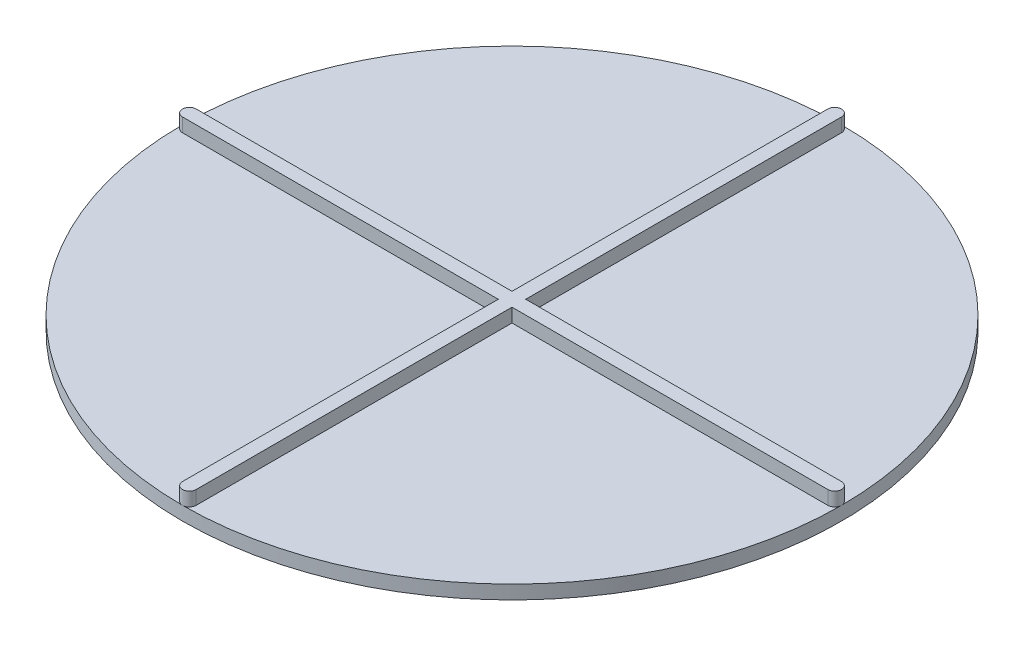
ISO-10303-21;
HEADER;
FILE_DESCRIPTION(('STEP AP214'),'2;1');
FILE_NAME('part.step','',(''),(''),'','','');
FILE_SCHEMA(('AUTOMOTIVE_DESIGN { 1 0 10303 214 1 1 1 1 }'));
ENDSEC;
DATA;
#1=APPLICATION_CONTEXT('core data for automotive mechanical design processes');
#2=APPLICATION_PROTOCOL_DEFINITION('international standard','automotive_design',2000,#1);
#3=PRODUCT_CONTEXT('',#1,'mechanical');
#4=PRODUCT('Part','Part','',(#3));
#5=PRODUCT_RELATED_PRODUCT_CATEGORY('part','',(#4));
#6=PRODUCT_DEFINITION_FORMATION('','',#4);
#7=PRODUCT_DEFINITION_CONTEXT('part definition',#1,'design');
#8=PRODUCT_DEFINITION('design','',#6,#7);
#9=PRODUCT_DEFINITION_SHAPE('','',#8);
#10=(LENGTH_UNIT() NAMED_UNIT(*) SI_UNIT(.MILLI.,.METRE.));
#11=(NAMED_UNIT(*) PLANE_ANGLE_UNIT() SI_UNIT($,.RADIAN.));
#12=(NAMED_UNIT(*) SI_UNIT($,.STERADIAN.) SOLID_ANGLE_UNIT());
#13=UNCERTAINTY_MEASURE_WITH_UNIT(LENGTH_MEASURE(1.E-05),#10,'distance_accuracy_value','');
#14=(GEOMETRIC_REPRESENTATION_CONTEXT(3) GLOBAL_UNCERTAINTY_ASSIGNED_CONTEXT((#13)) GLOBAL_UNIT_ASSIGNED_CONTEXT((#10,
#11,#12)) REPRESENTATION_CONTEXT('',''));
#15=CARTESIAN_POINT('',(0.,0.,0.));
#16=DIRECTION('',(0.,0.,1.));
#17=DIRECTION('',(1.,0.,0.));
#18=AXIS2_PLACEMENT_3D('',#15,#16,#17);
#19=CARTESIAN_POINT('',(0.,3.175,0.));
#20=DIRECTION('',(0.,1.,0.));
#21=DIRECTION('',(0.,0.,1.));
#22=AXIS2_PLACEMENT_3D('',#19,#20,#21);
#23=PLANE('',#22);
#24=CARTESIAN_POINT('',(74.6125,3.175,0.));
#25=DIRECTION('',(0.,1.,0.));
#26=DIRECTION('',(0.,0.,1.));
#27=AXIS2_PLACEMENT_3D('',#24,#25,#26);
#28=CIRCLE('',#27,1.5875);
#29=CARTESIAN_POINT('',(74.6125,3.175,1.5875));
#30=VERTEX_POINT('',#29);
#31=CARTESIAN_POINT('',(76.2,3.175,0.));
#32=VERTEX_POINT('',#31);
#33=EDGE_CURVE('E74',#30,#32,#28,.T.);
#34=ORIENTED_EDGE('',*,*,#33,.F.);
#35=DIRECTION('',(1.,0.,0.));
#36=VECTOR('',#35,1.);
#37=CARTESIAN_POINT('',(-74.6125,3.175,1.5875));
#38=LINE('',#37,#36);
#39=CARTESIAN_POINT('',(1.58750000000002,3.175,1.58750000000001));
#40=VERTEX_POINT('',#39);
#41=EDGE_CURVE('E84',#40,#30,#38,.T.);
#42=ORIENTED_EDGE('',*,*,#41,.F.);
#43=DIRECTION('',(0.,0.,1.));
#44=VECTOR('',#43,1.);
#45=CARTESIAN_POINT('',(1.58750000000002,3.175,-74.6125));
#46=LINE('',#45,#44);
#47=CARTESIAN_POINT('',(1.58750000000002,3.175,74.6125));
#48=VERTEX_POINT('',#47);
#49=EDGE_CURVE('E439',#40,#48,#46,.T.);
#50=ORIENTED_EDGE('',*,*,#49,.T.);
#51=CARTESIAN_POINT('',(0.,3.175,74.6125));
#52=DIRECTION('',(0.,1.,0.));
#53=DIRECTION('',(0.,0.,1.));
#54=AXIS2_PLACEMENT_3D('',#51,#52,#53);
#55=CIRCLE('',#54,1.5875);
#56=CARTESIAN_POINT('',(0.,3.175,76.2));
#57=VERTEX_POINT('',#56);
#58=EDGE_CURVE('E72',#57,#48,#55,.T.);
#59=ORIENTED_EDGE('',*,*,#58,.F.);
#60=CARTESIAN_POINT('',(0.,3.175,0.));
#61=DIRECTION('',(0.,1.,0.));
#62=DIRECTION('',(0.,0.,1.));
#63=AXIS2_PLACEMENT_3D('',#60,#61,#62);
#64=CIRCLE('',#63,76.2);
#65=EDGE_CURVE('E242',#57,#32,#64,.T.);
#66=ORIENTED_EDGE('',*,*,#65,.T.);
#67=EDGE_LOOP('',(#34,#42,#50,#59,#66));
#68=FACE_BOUND('',#67,.T.);
#69=ADVANCED_FACE('F63',(#68),#23,.T.);
#70=CARTESIAN_POINT('',(74.6125,3.175,-1.5875));
#71=VERTEX_POINT('',#70);
#72=EDGE_CURVE('E12',#32,#71,#28,.T.);
#73=ORIENTED_EDGE('',*,*,#72,.F.);
#74=CARTESIAN_POINT('',(0.,3.175,-76.2));
#75=VERTEX_POINT('',#74);
#76=EDGE_CURVE('E243',#32,#75,#64,.T.);
#77=ORIENTED_EDGE('',*,*,#76,.T.);
#78=CARTESIAN_POINT('',(0.,3.175,-74.6125));
#79=DIRECTION('',(0.,1.,0.));
#80=DIRECTION('',(0.,0.,1.));
#81=AXIS2_PLACEMENT_3D('',#78,#79,#80);
#82=CIRCLE('',#81,1.5875);
#83=CARTESIAN_POINT('',(1.58750000000002,3.175,-74.6125));
#84=VERTEX_POINT('',#83);
#85=EDGE_CURVE('E237',#84,#75,#82,.T.);
#86=ORIENTED_EDGE('',*,*,#85,.F.);
#87=CARTESIAN_POINT('',(1.58750000000002,3.175,-1.58750000000001));
#88=VERTEX_POINT('',#87);
#89=EDGE_CURVE('E188',#84,#88,#46,.T.);
#90=ORIENTED_EDGE('',*,*,#89,.T.);
#91=DIRECTION('',(1.,0.,0.));
#92=VECTOR('',#91,1.);
#93=CARTESIAN_POINT('',(-74.6125,3.175,-1.5875));
#94=LINE('',#93,#92);
#95=EDGE_CURVE('E218',#88,#71,#94,.T.);
#96=ORIENTED_EDGE('',*,*,#95,.T.);
#97=EDGE_LOOP('',(#73,#77,#86,#90,#96));
#98=FACE_BOUND('',#97,.T.);
#99=ADVANCED_FACE('F272',(#98),#23,.T.);
#100=CARTESIAN_POINT('',(-1.58749999999998,3.175,74.6125));
#101=VERTEX_POINT('',#100);
#102=EDGE_CURVE('E433',#101,#57,#55,.T.);
#103=ORIENTED_EDGE('',*,*,#102,.F.);
#104=DIRECTION('',(0.,0.,1.));
#105=VECTOR('',#104,1.);
#106=CARTESIAN_POINT('',(-1.58749999999998,3.175,-74.6125));
#107=LINE('',#106,#105);
#108=CARTESIAN_POINT('',(-1.58749999999998,3.175,1.58750000000001));
#109=VERTEX_POINT('',#108);
#110=EDGE_CURVE('E443',#109,#101,#107,.T.);
#111=ORIENTED_EDGE('',*,*,#110,.F.);
#112=CARTESIAN_POINT('',(-74.6125,3.175,1.5875));
#113=VERTEX_POINT('',#112);
#114=EDGE_CURVE('E208',#113,#109,#38,.T.);
#115=ORIENTED_EDGE('',*,*,#114,.F.);
#116=CARTESIAN_POINT('',(-74.6125,3.175,0.));
#117=DIRECTION('',(0.,1.,0.));
#118=DIRECTION('',(0.,0.,1.));
#119=AXIS2_PLACEMENT_3D('',#116,#117,#118);
#120=CIRCLE('',#119,1.5875);
#121=CARTESIAN_POINT('',(-76.2,3.175,0.));
#122=VERTEX_POINT('',#121);
#123=EDGE_CURVE('E224',#122,#113,#120,.T.);
#124=ORIENTED_EDGE('',*,*,#123,.F.);
#125=EDGE_CURVE('E244',#122,#57,#64,.T.);
#126=ORIENTED_EDGE('',*,*,#125,.T.);
#127=EDGE_LOOP('',(#103,#111,#115,#124,#126));
#128=FACE_BOUND('',#127,.T.);
#129=ADVANCED_FACE('F271',(#128),#23,.T.);
#130=CARTESIAN_POINT('',(0.,3.175,0.));
#131=DIRECTION('',(0.,-1.,0.));
#132=DIRECTION('',(0.,0.,-1.));
#133=AXIS2_PLACEMENT_3D('',#130,#131,#132);
#134=CYLINDRICAL_SURFACE('',#133,76.2);
#135=ORIENTED_EDGE('',*,*,#65,.F.);
#136=ORIENTED_EDGE('',*,*,#125,.F.);
#137=EDGE_CURVE('E248',#75,#122,#64,.T.);
#138=ORIENTED_EDGE('',*,*,#137,.F.);
#139=ORIENTED_EDGE('',*,*,#76,.F.);
#140=EDGE_LOOP('',(#135,#136,#138,#139));
#141=FACE_BOUND('',#140,.T.);
#142=CARTESIAN_POINT('',(0.,0.,0.));
#143=DIRECTION('',(0.,1.,0.));
#144=DIRECTION('',(0.,0.,1.));
#145=AXIS2_PLACEMENT_3D('',#142,#143,#144);
#146=CIRCLE('',#145,76.2);
#147=CARTESIAN_POINT('',(0.,0.,76.2));
#148=VERTEX_POINT('',#147);
#149=EDGE_CURVE('E67',#148,#148,#146,.T.);
#150=ORIENTED_EDGE('',*,*,#149,.T.);
#151=EDGE_LOOP('',(#150));
#152=FACE_BOUND('',#151,.T.);
#153=ADVANCED_FACE('F65',(#141,#152),#134,.T.);
#154=CARTESIAN_POINT('',(-74.6125,3.175,-1.5875));
#155=VERTEX_POINT('',#154);
#156=EDGE_CURVE('E221',#155,#122,#120,.T.);
#157=ORIENTED_EDGE('',*,*,#156,.F.);
#158=CARTESIAN_POINT('',(-1.58749999999998,3.175,-1.58750000000001));
#159=VERTEX_POINT('',#158);
#160=EDGE_CURVE('E219',#155,#159,#94,.T.);
#161=ORIENTED_EDGE('',*,*,#160,.T.);
#162=CARTESIAN_POINT('',(-1.58749999999998,3.175,-74.6125));
#163=VERTEX_POINT('',#162);
#164=EDGE_CURVE('E440',#163,#159,#107,.T.);
#165=ORIENTED_EDGE('',*,*,#164,.F.);
#166=EDGE_CURVE('E193',#75,#163,#82,.T.);
#167=ORIENTED_EDGE('',*,*,#166,.F.);
#168=ORIENTED_EDGE('',*,*,#137,.T.);
#169=EDGE_LOOP('',(#157,#161,#165,#167,#168));
#170=FACE_BOUND('',#169,.T.);
#171=ADVANCED_FACE('F260',(#170),#23,.T.);
#172=CARTESIAN_POINT('',(0.,0.,0.));
#173=DIRECTION('',(0.,1.,0.));
#174=DIRECTION('',(0.,0.,1.));
#175=AXIS2_PLACEMENT_3D('',#172,#173,#174);
#176=PLANE('',#175);
#177=ORIENTED_EDGE('',*,*,#149,.F.);
#178=EDGE_LOOP('',(#177));
#179=FACE_BOUND('',#178,.T.);
#180=ADVANCED_FACE('F257',(#179),#176,.F.);
#181=CARTESIAN_POINT('',(-1.58749999999998,6.35,-74.6125));
#182=DIRECTION('',(1.,0.,0.));
#183=DIRECTION('',(0.,0.,-1.));
#184=AXIS2_PLACEMENT_3D('',#181,#182,#183);
#185=PLANE('',#184);
#186=DIRECTION('',(0.,1.,0.));
#187=VECTOR('',#186,1.);
#188=CARTESIAN_POINT('',(-1.58749999999998,6.35,1.58750000000001));
#189=LINE('',#188,#187);
#190=CARTESIAN_POINT('',(-1.58749999999998,6.35,1.58750000000001));
#191=VERTEX_POINT('',#190);
#192=EDGE_CURVE('E239',#109,#191,#189,.T.);
#193=ORIENTED_EDGE('',*,*,#192,.F.);
#194=ORIENTED_EDGE('',*,*,#110,.T.);
#195=DIRECTION('',(0.,-1.,0.));
#196=VECTOR('',#195,1.);
#197=CARTESIAN_POINT('',(-1.58749999999998,6.35,74.6125));
#198=LINE('',#197,#196);
#199=CARTESIAN_POINT('',(-1.58749999999998,6.35,74.6125));
#200=VERTEX_POINT('',#199);
#201=EDGE_CURVE('E195',#200,#101,#198,.T.);
#202=ORIENTED_EDGE('',*,*,#201,.F.);
#203=DIRECTION('',(0.,0.,1.));
#204=VECTOR('',#203,1.);
#205=CARTESIAN_POINT('',(-1.58749999999998,6.35,-74.6125));
#206=LINE('',#205,#204);
#207=EDGE_CURVE('E177',#191,#200,#206,.T.);
#208=ORIENTED_EDGE('',*,*,#207,.F.);
#209=EDGE_LOOP('',(#193,#194,#202,#208));
#210=FACE_BOUND('',#209,.T.);
#211=ADVANCED_FACE('F259',(#210),#185,.F.);
#212=CARTESIAN_POINT('',(0.,6.35,74.6125));
#213=DIRECTION('',(0.,-1.,0.));
#214=DIRECTION('',(0.,0.,-1.));
#215=AXIS2_PLACEMENT_3D('',#212,#213,#214);
#216=CYLINDRICAL_SURFACE('',#215,1.5875);
#217=ORIENTED_EDGE('',*,*,#102,.T.);
#218=ORIENTED_EDGE('',*,*,#58,.T.);
#219=DIRECTION('',(0.,-1.,0.));
#220=VECTOR('',#219,1.);
#221=CARTESIAN_POINT('',(1.58750000000002,6.35,74.6125));
#222=LINE('',#221,#220);
#223=CARTESIAN_POINT('',(1.58750000000002,6.35,74.6125));
#224=VERTEX_POINT('',#223);
#225=EDGE_CURVE('E200',#224,#48,#222,.T.);
#226=ORIENTED_EDGE('',*,*,#225,.F.);
#227=CARTESIAN_POINT('',(0.,6.35,74.6125));
#228=DIRECTION('',(0.,1.,0.));
#229=DIRECTION('',(0.,0.,1.));
#230=AXIS2_PLACEMENT_3D('',#227,#228,#229);
#231=CIRCLE('',#230,1.5875);
#232=EDGE_CURVE('E176',#200,#224,#231,.T.);
#233=ORIENTED_EDGE('',*,*,#232,.F.);
#234=ORIENTED_EDGE('',*,*,#201,.T.);
#235=EDGE_LOOP('',(#217,#218,#226,#233,#234));
#236=FACE_BOUND('',#235,.T.);
#237=ADVANCED_FACE('F265',(#236),#216,.T.);
#238=CARTESIAN_POINT('',(1.58750000000002,6.35,-74.6125));
#239=DIRECTION('',(1.,0.,0.));
#240=DIRECTION('',(0.,0.,-1.));
#241=AXIS2_PLACEMENT_3D('',#238,#239,#240);
#242=PLANE('',#241);
#243=ORIENTED_EDGE('',*,*,#49,.F.);
#244=DIRECTION('',(0.,1.,0.));
#245=VECTOR('',#244,1.);
#246=CARTESIAN_POINT('',(1.58750000000002,6.35,1.58750000000001));
#247=LINE('',#246,#245);
#248=CARTESIAN_POINT('',(1.58750000000002,6.35,1.58750000000001));
#249=VERTEX_POINT('',#248);
#250=EDGE_CURVE('E194',#40,#249,#247,.T.);
#251=ORIENTED_EDGE('',*,*,#250,.T.);
#252=DIRECTION('',(0.,0.,1.));
#253=VECTOR('',#252,1.);
#254=CARTESIAN_POINT('',(1.58750000000002,6.35,-74.6125));
#255=LINE('',#254,#253);
#256=EDGE_CURVE('E454',#249,#224,#255,.T.);
#257=ORIENTED_EDGE('',*,*,#256,.T.);
#258=ORIENTED_EDGE('',*,*,#225,.T.);
#259=EDGE_LOOP('',(#243,#251,#257,#258));
#260=FACE_BOUND('',#259,.T.);
#261=ADVANCED_FACE('F297',(#260),#242,.T.);
#262=CARTESIAN_POINT('',(0.,6.35,-74.6125));
#263=DIRECTION('',(0.,-1.,0.));
#264=DIRECTION('',(0.,0.,-1.));
#265=AXIS2_PLACEMENT_3D('',#262,#263,#264);
#266=CYLINDRICAL_SURFACE('',#265,1.5875);
#267=ORIENTED_EDGE('',*,*,#85,.T.);
#268=ORIENTED_EDGE('',*,*,#166,.T.);
#269=DIRECTION('',(0.,-1.,0.));
#270=VECTOR('',#269,1.);
#271=CARTESIAN_POINT('',(-1.58749999999998,6.35,-74.6125));
#272=LINE('',#271,#270);
#273=CARTESIAN_POINT('',(-1.58749999999998,6.35,-74.6125));
#274=VERTEX_POINT('',#273);
#275=EDGE_CURVE('E170',#274,#163,#272,.T.);
#276=ORIENTED_EDGE('',*,*,#275,.F.);
#277=CARTESIAN_POINT('',(0.,6.35,-74.6125));
#278=DIRECTION('',(0.,1.,0.));
#279=DIRECTION('',(0.,0.,1.));
#280=AXIS2_PLACEMENT_3D('',#277,#278,#279);
#281=CIRCLE('',#280,1.5875);
#282=CARTESIAN_POINT('',(1.58750000000002,6.35,-74.6125));
#283=VERTEX_POINT('',#282);
#284=EDGE_CURVE('E181',#283,#274,#281,.T.);
#285=ORIENTED_EDGE('',*,*,#284,.F.);
#286=DIRECTION('',(0.,-1.,0.));
#287=VECTOR('',#286,1.);
#288=CARTESIAN_POINT('',(1.58750000000002,6.35,-74.6125));
#289=LINE('',#288,#287);
#290=EDGE_CURVE('E455',#283,#84,#289,.T.);
#291=ORIENTED_EDGE('',*,*,#290,.T.);
#292=EDGE_LOOP('',(#267,#268,#276,#285,#291));
#293=FACE_BOUND('',#292,.T.);
#294=ADVANCED_FACE('F192',(#293),#266,.T.);
#295=ORIENTED_EDGE('',*,*,#164,.T.);
#296=DIRECTION('',(0.,1.,0.));
#297=VECTOR('',#296,1.);
#298=CARTESIAN_POINT('',(-1.58749999999998,6.35,-1.58750000000001));
#299=LINE('',#298,#297);
#300=CARTESIAN_POINT('',(-1.58749999999998,6.35,-1.58750000000001));
#301=VERTEX_POINT('',#300);
#302=EDGE_CURVE('E172',#159,#301,#299,.T.);
#303=ORIENTED_EDGE('',*,*,#302,.T.);
#304=EDGE_CURVE('E165',#274,#301,#206,.T.);
#305=ORIENTED_EDGE('',*,*,#304,.F.);
#306=ORIENTED_EDGE('',*,*,#275,.T.);
#307=EDGE_LOOP('',(#295,#303,#305,#306));
#308=FACE_BOUND('',#307,.T.);
#309=ADVANCED_FACE('F168',(#308),#185,.F.);
#310=DIRECTION('',(0.,1.,0.));
#311=VECTOR('',#310,1.);
#312=CARTESIAN_POINT('',(1.58750000000002,6.35,-1.58750000000001));
#313=LINE('',#312,#311);
#314=CARTESIAN_POINT('',(1.58750000000002,6.35,-1.58750000000001));
#315=VERTEX_POINT('',#314);
#316=EDGE_CURVE('E197',#88,#315,#313,.T.);
#317=ORIENTED_EDGE('',*,*,#316,.F.);
#318=ORIENTED_EDGE('',*,*,#89,.F.);
#319=ORIENTED_EDGE('',*,*,#290,.F.);
#320=EDGE_CURVE('E185',#283,#315,#255,.T.);
#321=ORIENTED_EDGE('',*,*,#320,.T.);
#322=EDGE_LOOP('',(#317,#318,#319,#321));
#323=FACE_BOUND('',#322,.T.);
#324=ADVANCED_FACE('F300',(#323),#242,.T.);
#325=CARTESIAN_POINT('',(0.,6.35,-74.6125));
#326=DIRECTION('',(0.,1.,0.));
#327=DIRECTION('',(0.,0.,1.));
#328=AXIS2_PLACEMENT_3D('',#325,#326,#327);
#329=PLANE('',#328);
#330=ORIENTED_EDGE('',*,*,#304,.T.);
#331=DIRECTION('',(1.,0.,0.));
#332=VECTOR('',#331,1.);
#333=CARTESIAN_POINT('',(-74.6125,6.35,-1.5875));
#334=LINE('',#333,#332);
#335=CARTESIAN_POINT('',(-74.6125,6.35,-1.5875));
#336=VERTEX_POINT('',#335);
#337=EDGE_CURVE('E209',#336,#301,#334,.T.);
#338=ORIENTED_EDGE('',*,*,#337,.F.);
#339=CARTESIAN_POINT('',(-74.6125,6.35,0.));
#340=DIRECTION('',(0.,1.,0.));
#341=DIRECTION('',(0.,0.,1.));
#342=AXIS2_PLACEMENT_3D('',#339,#340,#341);
#343=CIRCLE('',#342,1.5875);
#344=CARTESIAN_POINT('',(-74.6125,6.35,1.5875));
#345=VERTEX_POINT('',#344);
#346=EDGE_CURVE('E211',#336,#345,#343,.T.);
#347=ORIENTED_EDGE('',*,*,#346,.T.);
#348=DIRECTION('',(1.,0.,0.));
#349=VECTOR('',#348,1.);
#350=CARTESIAN_POINT('',(-74.6125,6.35,1.5875));
#351=LINE('',#350,#349);
#352=EDGE_CURVE('E214',#345,#191,#351,.T.);
#353=ORIENTED_EDGE('',*,*,#352,.T.);
#354=ORIENTED_EDGE('',*,*,#207,.T.);
#355=ORIENTED_EDGE('',*,*,#232,.T.);
#356=ORIENTED_EDGE('',*,*,#256,.F.);
#357=CARTESIAN_POINT('',(74.6125,6.35,1.5875));
#358=VERTEX_POINT('',#357);
#359=EDGE_CURVE('E213',#249,#358,#351,.T.);
#360=ORIENTED_EDGE('',*,*,#359,.T.);
#361=CARTESIAN_POINT('',(74.6125,6.35,0.));
#362=DIRECTION('',(0.,1.,0.));
#363=DIRECTION('',(0.,0.,1.));
#364=AXIS2_PLACEMENT_3D('',#361,#362,#363);
#365=CIRCLE('',#364,1.5875);
#366=CARTESIAN_POINT('',(74.6125,6.35,-1.5875));
#367=VERTEX_POINT('',#366);
#368=EDGE_CURVE('E204',#358,#367,#365,.T.);
#369=ORIENTED_EDGE('',*,*,#368,.T.);
#370=EDGE_CURVE('E207',#315,#367,#334,.T.);
#371=ORIENTED_EDGE('',*,*,#370,.F.);
#372=ORIENTED_EDGE('',*,*,#320,.F.);
#373=ORIENTED_EDGE('',*,*,#284,.T.);
#374=EDGE_LOOP('',(#330,#338,#347,#353,#354,#355,#356,#360,#369,#371,#372,#373));
#375=FACE_BOUND('',#374,.T.);
#376=ADVANCED_FACE('F182',(#375),#329,.T.);
#377=CARTESIAN_POINT('',(-74.6125,6.35,1.5875));
#378=DIRECTION('',(0.,0.,-1.));
#379=DIRECTION('',(-1.,0.,0.));
#380=AXIS2_PLACEMENT_3D('',#377,#378,#379);
#381=PLANE('',#380);
#382=ORIENTED_EDGE('',*,*,#250,.F.);
#383=ORIENTED_EDGE('',*,*,#41,.T.);
#384=DIRECTION('',(0.,-1.,0.));
#385=VECTOR('',#384,1.);
#386=CARTESIAN_POINT('',(74.6125,6.35,1.5875));
#387=LINE('',#386,#385);
#388=EDGE_CURVE('E216',#358,#30,#387,.T.);
#389=ORIENTED_EDGE('',*,*,#388,.F.);
#390=ORIENTED_EDGE('',*,*,#359,.F.);
#391=EDGE_LOOP('',(#382,#383,#389,#390));
#392=FACE_BOUND('',#391,.T.);
#393=ADVANCED_FACE('F282',(#392),#381,.F.);
#394=CARTESIAN_POINT('',(74.6125,6.35,0.));
#395=DIRECTION('',(0.,-1.,0.));
#396=DIRECTION('',(0.,0.,-1.));
#397=AXIS2_PLACEMENT_3D('',#394,#395,#396);
#398=CYLINDRICAL_SURFACE('',#397,1.5875);
#399=ORIENTED_EDGE('',*,*,#33,.T.);
#400=ORIENTED_EDGE('',*,*,#72,.T.);
#401=DIRECTION('',(0.,-1.,0.));
#402=VECTOR('',#401,1.);
#403=CARTESIAN_POINT('',(74.6125,6.35,-1.5875));
#404=LINE('',#403,#402);
#405=EDGE_CURVE('E235',#367,#71,#404,.T.);
#406=ORIENTED_EDGE('',*,*,#405,.F.);
#407=ORIENTED_EDGE('',*,*,#368,.F.);
#408=ORIENTED_EDGE('',*,*,#388,.T.);
#409=EDGE_LOOP('',(#399,#400,#406,#407,#408));
#410=FACE_BOUND('',#409,.T.);
#411=ADVANCED_FACE('F278',(#410),#398,.T.);
#412=CARTESIAN_POINT('',(-74.6125,6.35,-1.5875));
#413=DIRECTION('',(0.,0.,-1.));
#414=DIRECTION('',(-1.,0.,0.));
#415=AXIS2_PLACEMENT_3D('',#412,#413,#414);
#416=PLANE('',#415);
#417=ORIENTED_EDGE('',*,*,#95,.F.);
#418=ORIENTED_EDGE('',*,*,#316,.T.);
#419=ORIENTED_EDGE('',*,*,#370,.T.);
#420=ORIENTED_EDGE('',*,*,#405,.T.);
#421=EDGE_LOOP('',(#417,#418,#419,#420));
#422=FACE_BOUND('',#421,.T.);
#423=ADVANCED_FACE('F281',(#422),#416,.T.);
#424=CARTESIAN_POINT('',(-74.6125,6.35,0.));
#425=DIRECTION('',(0.,-1.,0.));
#426=DIRECTION('',(0.,0.,-1.));
#427=AXIS2_PLACEMENT_3D('',#424,#425,#426);
#428=CYLINDRICAL_SURFACE('',#427,1.5875);
#429=ORIENTED_EDGE('',*,*,#156,.T.);
#430=ORIENTED_EDGE('',*,*,#123,.T.);
#431=DIRECTION('',(0.,-1.,0.));
#432=VECTOR('',#431,1.);
#433=CARTESIAN_POINT('',(-74.6125,6.35,1.5875));
#434=LINE('',#433,#432);
#435=EDGE_CURVE('E229',#345,#113,#434,.T.);
#436=ORIENTED_EDGE('',*,*,#435,.F.);
#437=ORIENTED_EDGE('',*,*,#346,.F.);
#438=DIRECTION('',(0.,-1.,0.));
#439=VECTOR('',#438,1.);
#440=CARTESIAN_POINT('',(-74.6125,6.35,-1.5875));
#441=LINE('',#440,#439);
#442=EDGE_CURVE('E232',#336,#155,#441,.T.);
#443=ORIENTED_EDGE('',*,*,#442,.T.);
#444=EDGE_LOOP('',(#429,#430,#436,#437,#443));
#445=FACE_BOUND('',#444,.T.);
#446=ADVANCED_FACE('F286',(#445),#428,.T.);
#447=ORIENTED_EDGE('',*,*,#114,.T.);
#448=ORIENTED_EDGE('',*,*,#192,.T.);
#449=ORIENTED_EDGE('',*,*,#352,.F.);
#450=ORIENTED_EDGE('',*,*,#435,.T.);
#451=EDGE_LOOP('',(#447,#448,#449,#450));
#452=FACE_BOUND('',#451,.T.);
#453=ADVANCED_FACE('F291',(#452),#381,.F.);
#454=ORIENTED_EDGE('',*,*,#302,.F.);
#455=ORIENTED_EDGE('',*,*,#160,.F.);
#456=ORIENTED_EDGE('',*,*,#442,.F.);
#457=ORIENTED_EDGE('',*,*,#337,.T.);
#458=EDGE_LOOP('',(#454,#455,#456,#457));
#459=FACE_BOUND('',#458,.T.);
#460=ADVANCED_FACE('F288',(#459),#416,.T.);
#461=CLOSED_SHELL('',(#69,#99,#129,#153,#171,#180,#211,#237,#261,#294,#309,#324,#376,#393,#411,
#423,#446,#453,#460));
#462=MANIFOLD_SOLID_BREP('B2',#461);
#463=ADVANCED_BREP_SHAPE_REPRESENTATION('',(#18,#462),#14);
#464=SHAPE_DEFINITION_REPRESENTATION(#9,#463);
ENDSEC;
END-ISO-10303-21;
